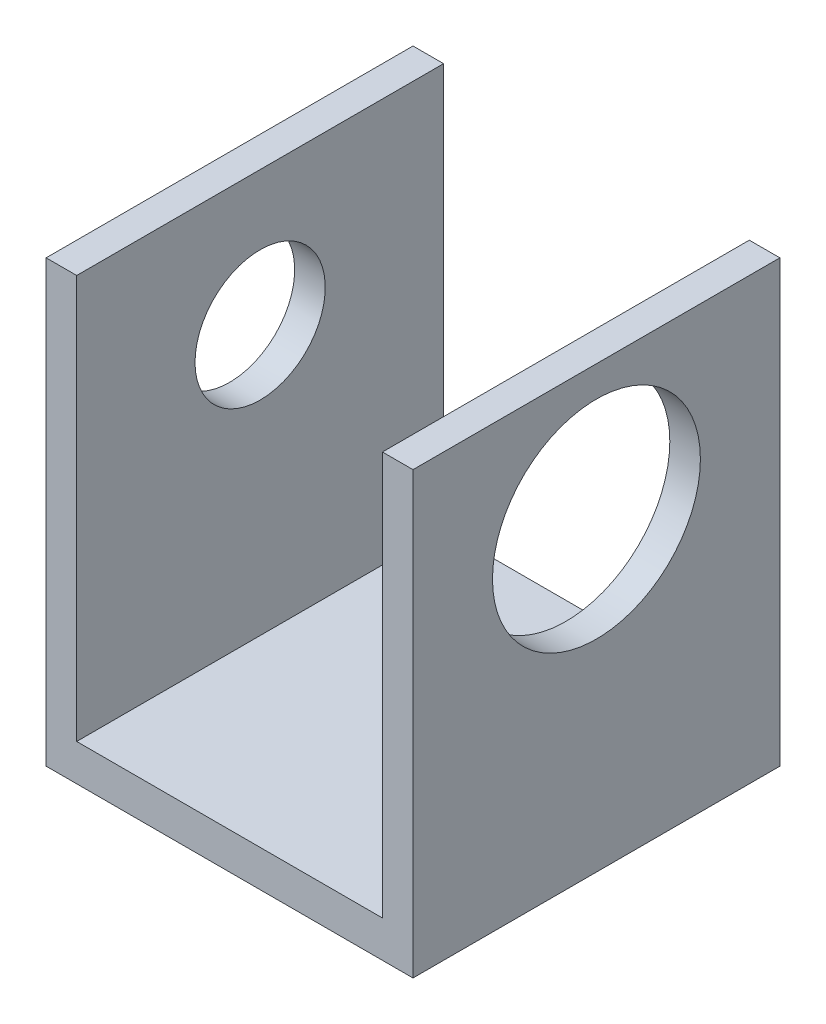
ISO-10303-21;
HEADER;
FILE_DESCRIPTION(('STEP AP214'),'2;1');
FILE_NAME('part.step','',(''),(''),'','','');
FILE_SCHEMA(('AUTOMOTIVE_DESIGN { 1 0 10303 214 1 1 1 1 }'));
ENDSEC;
DATA;
#1=APPLICATION_CONTEXT('core data for automotive mechanical design processes');
#2=APPLICATION_PROTOCOL_DEFINITION('international standard','automotive_design',2000,#1);
#3=PRODUCT_CONTEXT('',#1,'mechanical');
#4=PRODUCT('Part','Part','',(#3));
#5=PRODUCT_RELATED_PRODUCT_CATEGORY('part','',(#4));
#6=PRODUCT_DEFINITION_FORMATION('','',#4);
#7=PRODUCT_DEFINITION_CONTEXT('part definition',#1,'design');
#8=PRODUCT_DEFINITION('design','',#6,#7);
#9=PRODUCT_DEFINITION_SHAPE('','',#8);
#10=(LENGTH_UNIT() NAMED_UNIT(*) SI_UNIT(.MILLI.,.METRE.));
#11=(NAMED_UNIT(*) PLANE_ANGLE_UNIT() SI_UNIT($,.RADIAN.));
#12=(NAMED_UNIT(*) SI_UNIT($,.STERADIAN.) SOLID_ANGLE_UNIT());
#13=UNCERTAINTY_MEASURE_WITH_UNIT(LENGTH_MEASURE(1.E-05),#10,'distance_accuracy_value','');
#14=(GEOMETRIC_REPRESENTATION_CONTEXT(3) GLOBAL_UNCERTAINTY_ASSIGNED_CONTEXT((#13)) GLOBAL_UNIT_ASSIGNED_CONTEXT((#10,
#11,#12)) REPRESENTATION_CONTEXT('',''));
#15=CARTESIAN_POINT('',(0.,0.,0.));
#16=DIRECTION('',(0.,0.,1.));
#17=DIRECTION('',(1.,0.,0.));
#18=AXIS2_PLACEMENT_3D('',#15,#16,#17);
#19=CARTESIAN_POINT('',(-2.71887323943662,6.85218661971831,7.62));
#20=DIRECTION('',(0.,-1.,0.));
#21=DIRECTION('',(0.,0.,-1.));
#22=AXIS2_PLACEMENT_3D('',#19,#20,#21);
#23=PLANE('',#22);
#24=DIRECTION('',(-1.,0.,0.));
#25=VECTOR('',#24,1.);
#26=CARTESIAN_POINT('',(-2.71887323943662,6.85218661971831,0.));
#27=LINE('',#26,#25);
#28=CARTESIAN_POINT('',(-2.71887323943662,6.85218661971831,0.));
#29=VERTEX_POINT('',#28);
#30=CARTESIAN_POINT('',(-3.35387323943662,6.85218661971831,0.));
#31=VERTEX_POINT('',#30);
#32=EDGE_CURVE('E132',#29,#31,#27,.T.);
#33=ORIENTED_EDGE('',*,*,#32,.T.);
#34=DIRECTION('',(0.,0.,-1.));
#35=VECTOR('',#34,1.);
#36=CARTESIAN_POINT('',(-3.35387323943662,6.85218661971831,7.62));
#37=LINE('',#36,#35);
#38=CARTESIAN_POINT('',(-3.35387323943662,6.85218661971831,7.62));
#39=VERTEX_POINT('',#38);
#40=EDGE_CURVE('E11',#39,#31,#37,.T.);
#41=ORIENTED_EDGE('',*,*,#40,.F.);
#42=DIRECTION('',(-1.,0.,0.));
#43=VECTOR('',#42,1.);
#44=CARTESIAN_POINT('',(-2.71887323943662,6.85218661971831,7.62));
#45=LINE('',#44,#43);
#46=CARTESIAN_POINT('',(-2.71887323943662,6.85218661971831,7.62));
#47=VERTEX_POINT('',#46);
#48=EDGE_CURVE('E147',#47,#39,#45,.T.);
#49=ORIENTED_EDGE('',*,*,#48,.F.);
#50=DIRECTION('',(0.,0.,-1.));
#51=VECTOR('',#50,1.);
#52=CARTESIAN_POINT('',(-2.71887323943662,6.85218661971831,7.62));
#53=LINE('',#52,#51);
#54=EDGE_CURVE('E128',#47,#29,#53,.T.);
#55=ORIENTED_EDGE('',*,*,#54,.T.);
#56=EDGE_LOOP('',(#33,#41,#49,#55));
#57=FACE_BOUND('',#56,.T.);
#58=ADVANCED_FACE('F36',(#57),#23,.F.);
#59=CARTESIAN_POINT('',(-3.35387323943662,6.85218661971831,7.62));
#60=DIRECTION('',(1.,0.,0.));
#61=DIRECTION('',(0.,1.,0.));
#62=AXIS2_PLACEMENT_3D('',#59,#60,#61);
#63=PLANE('',#62);
#64=CARTESIAN_POINT('',(-3.35387323943662,4.05818661971831,3.81));
#65=DIRECTION('',(-1.,0.,0.));
#66=DIRECTION('',(0.,0.,1.));
#67=AXIS2_PLACEMENT_3D('',#64,#65,#66);
#68=CIRCLE('',#67,1.35254999999999);
#69=CARTESIAN_POINT('',(-3.35387323943662,4.05818661971831,5.16254999999999));
#70=VERTEX_POINT('',#69);
#71=EDGE_CURVE('E182',#70,#70,#68,.T.);
#72=ORIENTED_EDGE('',*,*,#71,.F.);
#73=EDGE_LOOP('',(#72));
#74=FACE_BOUND('',#73,.T.);
#75=DIRECTION('',(0.,-1.,0.));
#76=VECTOR('',#75,1.);
#77=CARTESIAN_POINT('',(-3.35387323943662,6.85218661971831,0.));
#78=LINE('',#77,#76);
#79=CARTESIAN_POINT('',(-3.35387323943662,-2.29181338028169,0.));
#80=VERTEX_POINT('',#79);
#81=EDGE_CURVE('E135',#31,#80,#78,.T.);
#82=ORIENTED_EDGE('',*,*,#81,.T.);
#83=DIRECTION('',(0.,0.,-1.));
#84=VECTOR('',#83,1.);
#85=CARTESIAN_POINT('',(-3.35387323943662,-2.29181338028169,7.62));
#86=LINE('',#85,#84);
#87=CARTESIAN_POINT('',(-3.35387323943662,-2.29181338028169,7.62));
#88=VERTEX_POINT('',#87);
#89=EDGE_CURVE('E44',#88,#80,#86,.T.);
#90=ORIENTED_EDGE('',*,*,#89,.F.);
#91=DIRECTION('',(0.,-1.,0.));
#92=VECTOR('',#91,1.);
#93=CARTESIAN_POINT('',(-3.35387323943662,6.85218661971831,7.62));
#94=LINE('',#93,#92);
#95=EDGE_CURVE('E95',#39,#88,#94,.T.);
#96=ORIENTED_EDGE('',*,*,#95,.F.);
#97=ORIENTED_EDGE('',*,*,#40,.T.);
#98=EDGE_LOOP('',(#82,#90,#96,#97));
#99=FACE_BOUND('',#98,.T.);
#100=ADVANCED_FACE('F204',(#74,#99),#63,.F.);
#101=CARTESIAN_POINT('',(-3.35387323943662,-2.29181338028169,7.62));
#102=DIRECTION('',(0.,1.,0.));
#103=DIRECTION('',(0.,0.,1.));
#104=AXIS2_PLACEMENT_3D('',#101,#102,#103);
#105=PLANE('',#104);
#106=DIRECTION('',(1.,0.,0.));
#107=VECTOR('',#106,1.);
#108=CARTESIAN_POINT('',(-3.35387323943662,-2.29181338028169,0.));
#109=LINE('',#108,#107);
#110=CARTESIAN_POINT('',(4.26612676056338,-2.29181338028169,0.));
#111=VERTEX_POINT('',#110);
#112=EDGE_CURVE('E138',#80,#111,#109,.T.);
#113=ORIENTED_EDGE('',*,*,#112,.T.);
#114=DIRECTION('',(0.,0.,-1.));
#115=VECTOR('',#114,1.);
#116=CARTESIAN_POINT('',(4.26612676056338,-2.29181338028169,7.62));
#117=LINE('',#116,#115);
#118=CARTESIAN_POINT('',(4.26612676056338,-2.29181338028169,7.62));
#119=VERTEX_POINT('',#118);
#120=EDGE_CURVE('E154',#119,#111,#117,.T.);
#121=ORIENTED_EDGE('',*,*,#120,.F.);
#122=DIRECTION('',(1.,0.,0.));
#123=VECTOR('',#122,1.);
#124=CARTESIAN_POINT('',(-3.35387323943662,-2.29181338028169,7.62));
#125=LINE('',#124,#123);
#126=EDGE_CURVE('E162',#88,#119,#125,.T.);
#127=ORIENTED_EDGE('',*,*,#126,.F.);
#128=ORIENTED_EDGE('',*,*,#89,.T.);
#129=EDGE_LOOP('',(#113,#121,#127,#128));
#130=FACE_BOUND('',#129,.T.);
#131=ADVANCED_FACE('F160',(#130),#105,.F.);
#132=CARTESIAN_POINT('',(4.26612676056338,-2.29181338028169,7.62));
#133=DIRECTION('',(-1.,0.,0.));
#134=DIRECTION('',(0.,-1.,0.));
#135=AXIS2_PLACEMENT_3D('',#132,#133,#134);
#136=PLANE('',#135);
#137=CARTESIAN_POINT('',(4.26612676056338,4.05818661971831,3.81));
#138=DIRECTION('',(1.,0.,0.));
#139=DIRECTION('',(0.,0.,-1.));
#140=AXIS2_PLACEMENT_3D('',#137,#138,#139);
#141=CIRCLE('',#140,2.159);
#142=CARTESIAN_POINT('',(4.26612676056338,4.05818661971831,1.651));
#143=VERTEX_POINT('',#142);
#144=EDGE_CURVE('E185',#143,#143,#141,.T.);
#145=ORIENTED_EDGE('',*,*,#144,.F.);
#146=EDGE_LOOP('',(#145));
#147=FACE_BOUND('',#146,.T.);
#148=DIRECTION('',(0.,1.,0.));
#149=VECTOR('',#148,1.);
#150=CARTESIAN_POINT('',(4.26612676056338,-2.29181338028169,0.));
#151=LINE('',#150,#149);
#152=CARTESIAN_POINT('',(4.26612676056338,6.85218661971831,0.));
#153=VERTEX_POINT('',#152);
#154=EDGE_CURVE('E140',#111,#153,#151,.T.);
#155=ORIENTED_EDGE('',*,*,#154,.T.);
#156=DIRECTION('',(0.,0.,-1.));
#157=VECTOR('',#156,1.);
#158=CARTESIAN_POINT('',(4.26612676056338,6.85218661971831,7.62));
#159=LINE('',#158,#157);
#160=CARTESIAN_POINT('',(4.26612676056338,6.85218661971831,7.62));
#161=VERTEX_POINT('',#160);
#162=EDGE_CURVE('E151',#161,#153,#159,.T.);
#163=ORIENTED_EDGE('',*,*,#162,.F.);
#164=DIRECTION('',(0.,1.,0.));
#165=VECTOR('',#164,1.);
#166=CARTESIAN_POINT('',(4.26612676056338,-2.29181338028169,7.62));
#167=LINE('',#166,#165);
#168=EDGE_CURVE('E174',#119,#161,#167,.T.);
#169=ORIENTED_EDGE('',*,*,#168,.F.);
#170=ORIENTED_EDGE('',*,*,#120,.T.);
#171=EDGE_LOOP('',(#155,#163,#169,#170));
#172=FACE_BOUND('',#171,.T.);
#173=ADVANCED_FACE('F170',(#147,#172),#136,.F.);
#174=CARTESIAN_POINT('',(3.63112676056338,6.85218661971831,7.62));
#175=DIRECTION('',(0.,-1.,0.));
#176=DIRECTION('',(0.,0.,-1.));
#177=AXIS2_PLACEMENT_3D('',#174,#175,#176);
#178=PLANE('',#177);
#179=DIRECTION('',(-1.,0.,0.));
#180=VECTOR('',#179,1.);
#181=CARTESIAN_POINT('',(3.63112676056338,6.85218661971831,0.));
#182=LINE('',#181,#180);
#183=CARTESIAN_POINT('',(3.63112676056338,6.85218661971831,0.));
#184=VERTEX_POINT('',#183);
#185=EDGE_CURVE('E142',#153,#184,#182,.T.);
#186=ORIENTED_EDGE('',*,*,#185,.T.);
#187=DIRECTION('',(0.,0.,-1.));
#188=VECTOR('',#187,1.);
#189=CARTESIAN_POINT('',(3.63112676056338,6.85218661971831,7.62));
#190=LINE('',#189,#188);
#191=CARTESIAN_POINT('',(3.63112676056338,6.85218661971831,7.62));
#192=VERTEX_POINT('',#191);
#193=EDGE_CURVE('E123',#192,#184,#190,.T.);
#194=ORIENTED_EDGE('',*,*,#193,.F.);
#195=DIRECTION('',(-1.,0.,0.));
#196=VECTOR('',#195,1.);
#197=CARTESIAN_POINT('',(3.63112676056338,6.85218661971831,7.62));
#198=LINE('',#197,#196);
#199=EDGE_CURVE('E114',#161,#192,#198,.T.);
#200=ORIENTED_EDGE('',*,*,#199,.F.);
#201=ORIENTED_EDGE('',*,*,#162,.T.);
#202=EDGE_LOOP('',(#186,#194,#200,#201));
#203=FACE_BOUND('',#202,.T.);
#204=ADVANCED_FACE('F173',(#203),#178,.F.);
#205=CARTESIAN_POINT('',(3.63112676056338,6.85218661971831,7.62));
#206=DIRECTION('',(1.,0.,0.));
#207=DIRECTION('',(0.,1.,0.));
#208=AXIS2_PLACEMENT_3D('',#205,#206,#207);
#209=PLANE('',#208);
#210=CARTESIAN_POINT('',(3.63112676056338,4.05818661971831,3.81));
#211=DIRECTION('',(1.,0.,0.));
#212=DIRECTION('',(0.,1.,0.));
#213=AXIS2_PLACEMENT_3D('',#210,#211,#212);
#214=CIRCLE('',#213,2.159);
#215=CARTESIAN_POINT('',(3.63112676056338,6.21718661971831,3.81));
#216=VERTEX_POINT('',#215);
#217=EDGE_CURVE('E188',#216,#216,#214,.F.);
#218=ORIENTED_EDGE('',*,*,#217,.F.);
#219=EDGE_LOOP('',(#218));
#220=FACE_BOUND('',#219,.T.);
#221=DIRECTION('',(0.,-1.,0.));
#222=VECTOR('',#221,1.);
#223=CARTESIAN_POINT('',(3.63112676056338,6.85218661971831,0.));
#224=LINE('',#223,#222);
#225=CARTESIAN_POINT('',(3.63112676056338,-1.52981338028169,0.));
#226=VERTEX_POINT('',#225);
#227=EDGE_CURVE('E122',#184,#226,#224,.T.);
#228=ORIENTED_EDGE('',*,*,#227,.T.);
#229=DIRECTION('',(0.,0.,-1.));
#230=VECTOR('',#229,1.);
#231=CARTESIAN_POINT('',(3.63112676056338,-1.52981338028169,7.62));
#232=LINE('',#231,#230);
#233=CARTESIAN_POINT('',(3.63112676056338,-1.52981338028169,7.62));
#234=VERTEX_POINT('',#233);
#235=EDGE_CURVE('E119',#234,#226,#232,.T.);
#236=ORIENTED_EDGE('',*,*,#235,.F.);
#237=DIRECTION('',(0.,-1.,0.));
#238=VECTOR('',#237,1.);
#239=CARTESIAN_POINT('',(3.63112676056338,6.85218661971831,7.62));
#240=LINE('',#239,#238);
#241=EDGE_CURVE('E108',#192,#234,#240,.T.);
#242=ORIENTED_EDGE('',*,*,#241,.F.);
#243=ORIENTED_EDGE('',*,*,#193,.T.);
#244=EDGE_LOOP('',(#228,#236,#242,#243));
#245=FACE_BOUND('',#244,.T.);
#246=ADVANCED_FACE('F120',(#220,#245),#209,.F.);
#247=CARTESIAN_POINT('',(3.63112676056338,-1.52981338028169,7.62));
#248=DIRECTION('',(0.,-1.,0.));
#249=DIRECTION('',(1.,0.,0.));
#250=AXIS2_PLACEMENT_3D('',#247,#248,#249);
#251=PLANE('',#250);
#252=DIRECTION('',(-1.,0.,0.));
#253=VECTOR('',#252,1.);
#254=CARTESIAN_POINT('',(3.63112676056338,-1.52981338028169,0.));
#255=LINE('',#254,#253);
#256=CARTESIAN_POINT('',(-2.71887323943662,-1.52981338028169,0.));
#257=VERTEX_POINT('',#256);
#258=EDGE_CURVE('E81',#226,#257,#255,.T.);
#259=ORIENTED_EDGE('',*,*,#258,.T.);
#260=DIRECTION('',(0.,0.,-1.));
#261=VECTOR('',#260,1.);
#262=CARTESIAN_POINT('',(-2.71887323943662,-1.52981338028169,7.62));
#263=LINE('',#262,#261);
#264=CARTESIAN_POINT('',(-2.71887323943662,-1.52981338028169,7.62));
#265=VERTEX_POINT('',#264);
#266=EDGE_CURVE('E124',#265,#257,#263,.T.);
#267=ORIENTED_EDGE('',*,*,#266,.F.);
#268=DIRECTION('',(-1.,0.,0.));
#269=VECTOR('',#268,1.);
#270=CARTESIAN_POINT('',(3.63112676056338,-1.52981338028169,7.62));
#271=LINE('',#270,#269);
#272=EDGE_CURVE('E112',#234,#265,#271,.T.);
#273=ORIENTED_EDGE('',*,*,#272,.F.);
#274=ORIENTED_EDGE('',*,*,#235,.T.);
#275=EDGE_LOOP('',(#259,#267,#273,#274));
#276=FACE_BOUND('',#275,.T.);
#277=ADVANCED_FACE('F126',(#276),#251,.F.);
#278=CARTESIAN_POINT('',(-2.71887323943662,-1.52981338028169,7.62));
#279=DIRECTION('',(-1.,0.,0.));
#280=DIRECTION('',(0.,-1.,0.));
#281=AXIS2_PLACEMENT_3D('',#278,#279,#280);
#282=PLANE('',#281);
#283=CARTESIAN_POINT('',(-2.71887323943662,4.05818661971831,3.81));
#284=DIRECTION('',(-1.,0.,0.));
#285=DIRECTION('',(0.,-1.,0.));
#286=AXIS2_PLACEMENT_3D('',#283,#284,#285);
#287=CIRCLE('',#286,1.35254999999999);
#288=CARTESIAN_POINT('',(-2.71887323943662,2.70563661971832,3.81));
#289=VERTEX_POINT('',#288);
#290=EDGE_CURVE('E136',#289,#289,#287,.T.);
#291=ORIENTED_EDGE('',*,*,#290,.T.);
#292=EDGE_LOOP('',(#291));
#293=FACE_BOUND('',#292,.T.);
#294=DIRECTION('',(0.,1.,0.));
#295=VECTOR('',#294,1.);
#296=CARTESIAN_POINT('',(-2.71887323943662,-1.52981338028169,0.));
#297=LINE('',#296,#295);
#298=EDGE_CURVE('E87',#257,#29,#297,.T.);
#299=ORIENTED_EDGE('',*,*,#298,.T.);
#300=ORIENTED_EDGE('',*,*,#54,.F.);
#301=DIRECTION('',(0.,1.,0.));
#302=VECTOR('',#301,1.);
#303=CARTESIAN_POINT('',(-2.71887323943662,-1.52981338028169,7.62));
#304=LINE('',#303,#302);
#305=EDGE_CURVE('E52',#265,#47,#304,.T.);
#306=ORIENTED_EDGE('',*,*,#305,.F.);
#307=ORIENTED_EDGE('',*,*,#266,.T.);
#308=EDGE_LOOP('',(#299,#300,#306,#307));
#309=FACE_BOUND('',#308,.T.);
#310=ADVANCED_FACE('F200',(#293,#309),#282,.F.);
#311=CARTESIAN_POINT('',(0.,0.,7.62));
#312=DIRECTION('',(0.,0.,1.));
#313=DIRECTION('',(1.,0.,0.));
#314=AXIS2_PLACEMENT_3D('',#311,#312,#313);
#315=PLANE('',#314);
#316=ORIENTED_EDGE('',*,*,#48,.T.);
#317=ORIENTED_EDGE('',*,*,#95,.T.);
#318=ORIENTED_EDGE('',*,*,#126,.T.);
#319=ORIENTED_EDGE('',*,*,#168,.T.);
#320=ORIENTED_EDGE('',*,*,#199,.T.);
#321=ORIENTED_EDGE('',*,*,#241,.T.);
#322=ORIENTED_EDGE('',*,*,#272,.T.);
#323=ORIENTED_EDGE('',*,*,#305,.T.);
#324=EDGE_LOOP('',(#316,#317,#318,#319,#320,#321,#322,#323));
#325=FACE_BOUND('',#324,.T.);
#326=ADVANCED_FACE('F110',(#325),#315,.T.);
#327=CARTESIAN_POINT('',(0.,0.,0.));
#328=DIRECTION('',(0.,0.,1.));
#329=DIRECTION('',(1.,0.,0.));
#330=AXIS2_PLACEMENT_3D('',#327,#328,#329);
#331=PLANE('',#330);
#332=ORIENTED_EDGE('',*,*,#32,.F.);
#333=ORIENTED_EDGE('',*,*,#298,.F.);
#334=ORIENTED_EDGE('',*,*,#258,.F.);
#335=ORIENTED_EDGE('',*,*,#227,.F.);
#336=ORIENTED_EDGE('',*,*,#185,.F.);
#337=ORIENTED_EDGE('',*,*,#154,.F.);
#338=ORIENTED_EDGE('',*,*,#112,.F.);
#339=ORIENTED_EDGE('',*,*,#81,.F.);
#340=EDGE_LOOP('',(#332,#333,#334,#335,#336,#337,#338,#339));
#341=FACE_BOUND('',#340,.T.);
#342=ADVANCED_FACE('F166',(#341),#331,.F.);
#343=CARTESIAN_POINT('',(-3.35387323943662,4.05818661971831,3.81));
#344=DIRECTION('',(-1.,0.,0.));
#345=DIRECTION('',(0.,0.,1.));
#346=AXIS2_PLACEMENT_3D('',#343,#344,#345);
#347=CYLINDRICAL_SURFACE('',#346,1.35254999999999);
#348=ORIENTED_EDGE('',*,*,#290,.F.);
#349=EDGE_LOOP('',(#348));
#350=FACE_BOUND('',#349,.T.);
#351=ORIENTED_EDGE('',*,*,#71,.T.);
#352=EDGE_LOOP('',(#351));
#353=FACE_BOUND('',#352,.T.);
#354=ADVANCED_FACE('F221',(#350,#353),#347,.F.);
#355=CARTESIAN_POINT('',(-3.35487323943662,4.05818661971831,3.81));
#356=DIRECTION('',(1.,0.,0.));
#357=DIRECTION('',(0.,0.,-1.));
#358=AXIS2_PLACEMENT_3D('',#355,#356,#357);
#359=CYLINDRICAL_SURFACE('',#358,2.159);
#360=ORIENTED_EDGE('',*,*,#144,.T.);
#361=EDGE_LOOP('',(#360));
#362=FACE_BOUND('',#361,.T.);
#363=ORIENTED_EDGE('',*,*,#217,.T.);
#364=EDGE_LOOP('',(#363));
#365=FACE_BOUND('',#364,.T.);
#366=ADVANCED_FACE('F192',(#362,#365),#359,.F.);
#367=CLOSED_SHELL('',(#58,#100,#131,#173,#204,#246,#277,#310,#326,#342,#354,#366));
#368=MANIFOLD_SOLID_BREP('B2',#367);
#369=ADVANCED_BREP_SHAPE_REPRESENTATION('',(#18,#368),#14);
#370=SHAPE_DEFINITION_REPRESENTATION(#9,#369);
ENDSEC;
END-ISO-10303-21;
